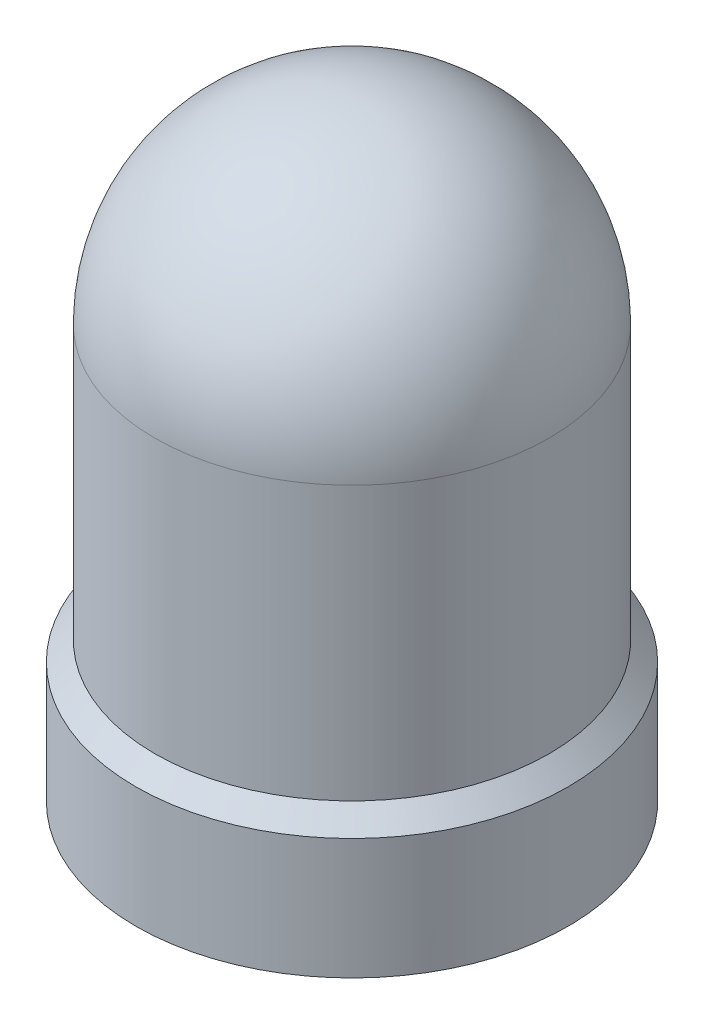
ISO-10303-21;
HEADER;
FILE_DESCRIPTION(('STEP AP214'),'2;1');
FILE_NAME('part.step','',(''),(''),'','','');
FILE_SCHEMA(('AUTOMOTIVE_DESIGN { 1 0 10303 214 1 1 1 1 }'));
ENDSEC;
DATA;
#1=APPLICATION_CONTEXT('core data for automotive mechanical design processes');
#2=APPLICATION_PROTOCOL_DEFINITION('international standard','automotive_design',2000,#1);
#3=PRODUCT_CONTEXT('',#1,'mechanical');
#4=PRODUCT('Part','Part','',(#3));
#5=PRODUCT_RELATED_PRODUCT_CATEGORY('part','',(#4));
#6=PRODUCT_DEFINITION_FORMATION('','',#4);
#7=PRODUCT_DEFINITION_CONTEXT('part definition',#1,'design');
#8=PRODUCT_DEFINITION('design','',#6,#7);
#9=PRODUCT_DEFINITION_SHAPE('','',#8);
#10=(LENGTH_UNIT() NAMED_UNIT(*) SI_UNIT(.MILLI.,.METRE.));
#11=(NAMED_UNIT(*) PLANE_ANGLE_UNIT() SI_UNIT($,.RADIAN.));
#12=(NAMED_UNIT(*) SI_UNIT($,.STERADIAN.) SOLID_ANGLE_UNIT());
#13=UNCERTAINTY_MEASURE_WITH_UNIT(LENGTH_MEASURE(1.E-05),#10,'distance_accuracy_value','');
#14=(GEOMETRIC_REPRESENTATION_CONTEXT(3) GLOBAL_UNCERTAINTY_ASSIGNED_CONTEXT((#13)) GLOBAL_UNIT_ASSIGNED_CONTEXT((#10,
#11,#12)) REPRESENTATION_CONTEXT('',''));
#15=CARTESIAN_POINT('',(0.,0.,0.));
#16=DIRECTION('',(0.,0.,1.));
#17=DIRECTION('',(1.,0.,0.));
#18=AXIS2_PLACEMENT_3D('',#15,#16,#17);
#19=CARTESIAN_POINT('',(-0.85,0.,0.));
#20=DIRECTION('',(0.,-1.,0.));
#21=DIRECTION('',(1.,0.,0.));
#22=AXIS2_PLACEMENT_3D('',#19,#20,#21);
#23=PLANE('',#22);
#24=CARTESIAN_POINT('',(0.,0.,0.));
#25=DIRECTION('',(0.,1.,0.));
#26=DIRECTION('',(0.,0.,1.));
#27=AXIS2_PLACEMENT_3D('',#24,#25,#26);
#28=CIRCLE('',#27,1.7);
#29=CARTESIAN_POINT('',(0.,0.,1.7));
#30=VERTEX_POINT('',#29);
#31=EDGE_CURVE('E19',#30,#30,#28,.T.);
#32=ORIENTED_EDGE('',*,*,#31,.F.);
#33=EDGE_LOOP('',(#32));
#34=FACE_BOUND('',#33,.T.);
#35=ADVANCED_FACE('F15',(#34),#23,.T.);
#36=CARTESIAN_POINT('',(0.,0.475,0.));
#37=DIRECTION('',(0.,1.,0.));
#38=DIRECTION('',(0.,0.,1.));
#39=AXIS2_PLACEMENT_3D('',#36,#37,#38);
#40=CYLINDRICAL_SURFACE('',#39,1.7);
#41=ORIENTED_EDGE('',*,*,#31,.T.);
#42=EDGE_LOOP('',(#41));
#43=FACE_BOUND('',#42,.T.);
#44=CARTESIAN_POINT('',(0.,0.949999999988904,0.));
#45=DIRECTION('',(0.,-1.,0.));
#46=DIRECTION('',(0.,0.,-1.));
#47=AXIS2_PLACEMENT_3D('',#44,#45,#46);
#48=CIRCLE('',#47,1.69999999997117);
#49=CARTESIAN_POINT('',(0.,0.949999999988904,-1.69999999997117));
#50=VERTEX_POINT('',#49);
#51=EDGE_CURVE('E28',#50,#50,#48,.F.);
#52=ORIENTED_EDGE('',*,*,#51,.F.);
#53=EDGE_LOOP('',(#52));
#54=FACE_BOUND('',#53,.T.);
#55=ADVANCED_FACE('F38',(#43,#54),#40,.T.);
#56=CARTESIAN_POINT('',(0.,0.949999999875217,0.));
#57=DIRECTION('',(0.,-1.,0.));
#58=DIRECTION('',(0.,0.,-1.));
#59=AXIS2_PLACEMENT_3D('',#56,#57,#58);
#60=CONICAL_SURFACE('',#59,1.70000000002801,0.785398184050558);
#61=CARTESIAN_POINT('',(0.,1.09999999384,0.));
#62=DIRECTION('',(0.,1.,0.));
#63=DIRECTION('',(0.,0.,1.));
#64=AXIS2_PLACEMENT_3D('',#61,#62,#63);
#65=CIRCLE('',#64,1.55);
#66=CARTESIAN_POINT('',(0.,1.09999999384,1.55));
#67=VERTEX_POINT('',#66);
#68=EDGE_CURVE('E23',#67,#67,#65,.T.);
#69=ORIENTED_EDGE('',*,*,#68,.F.);
#70=EDGE_LOOP('',(#69));
#71=FACE_BOUND('',#70,.T.);
#72=ORIENTED_EDGE('',*,*,#51,.T.);
#73=EDGE_LOOP('',(#72));
#74=FACE_BOUND('',#73,.T.);
#75=ADVANCED_FACE('F46',(#71,#74),#60,.T.);
#76=CARTESIAN_POINT('',(0.,3.24999999384,0.));
#77=DIRECTION('',(1.,0.,0.));
#78=DIRECTION('',(0.,0.,1.));
#79=AXIS2_PLACEMENT_3D('',#76,#77,#78);
#80=SPHERICAL_SURFACE('',#79,1.55);
#81=CARTESIAN_POINT('',(0.,3.24999999384,0.));
#82=DIRECTION('',(0.,1.,0.));
#83=DIRECTION('',(0.,0.,1.));
#84=AXIS2_PLACEMENT_3D('',#81,#82,#83);
#85=SPHERICAL_SURFACE('',#84,1.55);
#86=CARTESIAN_POINT('',(0.,3.24999999384,0.));
#87=DIRECTION('',(0.,1.,0.));
#88=DIRECTION('',(0.,0.,1.));
#89=AXIS2_PLACEMENT_3D('',#86,#87,#88);
#90=CIRCLE('',#89,1.55);
#91=CARTESIAN_POINT('',(0.,3.24999999384,1.55));
#92=VERTEX_POINT('',#91);
#93=EDGE_CURVE('E10',#92,#92,#90,.F.);
#94=ORIENTED_EDGE('',*,*,#93,.F.);
#95=EDGE_LOOP('',(#94));
#96=FACE_BOUND('',#95,.T.);
#97=ADVANCED_FACE('F17',(#96),#85,.T.);
#98=CARTESIAN_POINT('',(0.,2.17499999384,0.));
#99=DIRECTION('',(0.,1.,0.));
#100=DIRECTION('',(0.,0.,1.));
#101=AXIS2_PLACEMENT_3D('',#98,#99,#100);
#102=CYLINDRICAL_SURFACE('',#101,1.55);
#103=ORIENTED_EDGE('',*,*,#68,.T.);
#104=EDGE_LOOP('',(#103));
#105=FACE_BOUND('',#104,.T.);
#106=ORIENTED_EDGE('',*,*,#93,.T.);
#107=EDGE_LOOP('',(#106));
#108=FACE_BOUND('',#107,.T.);
#109=ADVANCED_FACE('F48',(#105,#108),#102,.T.);
#110=CLOSED_SHELL('',(#35,#55,#75,#97,#109));
#111=MANIFOLD_SOLID_BREP('B1',#110);
#112=ADVANCED_BREP_SHAPE_REPRESENTATION('',(#18,#111),#14);
#113=SHAPE_DEFINITION_REPRESENTATION(#9,#112);
ENDSEC;
END-ISO-10303-21;
